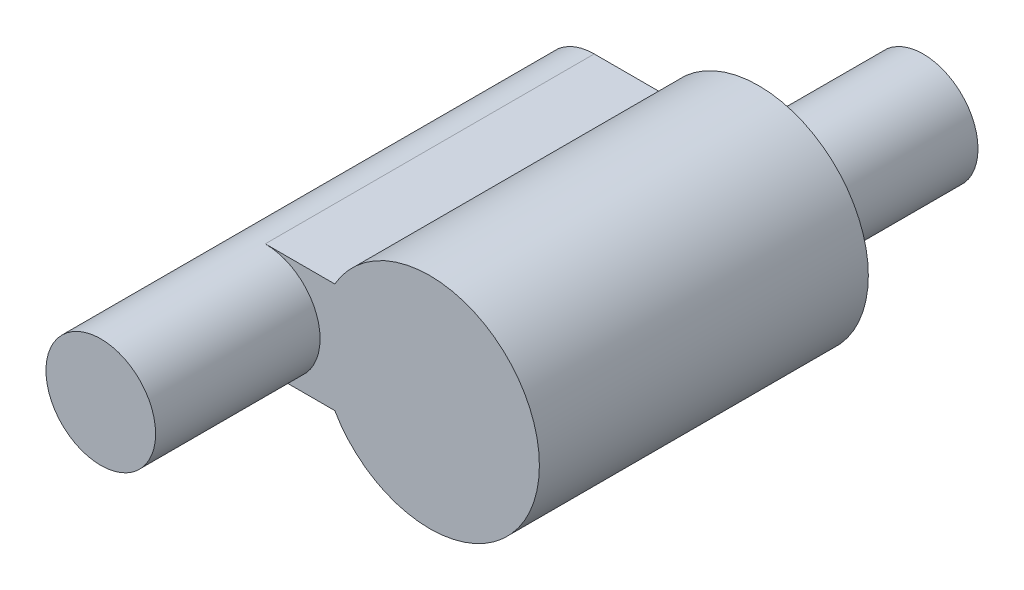
ISO-10303-21;
HEADER;
FILE_DESCRIPTION(('STEP AP214'),'2;1');
FILE_NAME('part.step','',(''),(''),'','','');
FILE_SCHEMA(('AUTOMOTIVE_DESIGN { 1 0 10303 214 1 1 1 1 }'));
ENDSEC;
DATA;
#1=APPLICATION_CONTEXT('core data for automotive mechanical design processes');
#2=APPLICATION_PROTOCOL_DEFINITION('international standard','automotive_design',2000,#1);
#3=PRODUCT_CONTEXT('',#1,'mechanical');
#4=PRODUCT('Part','Part','',(#3));
#5=PRODUCT_RELATED_PRODUCT_CATEGORY('part','',(#4));
#6=PRODUCT_DEFINITION_FORMATION('','',#4);
#7=PRODUCT_DEFINITION_CONTEXT('part definition',#1,'design');
#8=PRODUCT_DEFINITION('design','',#6,#7);
#9=PRODUCT_DEFINITION_SHAPE('','',#8);
#10=(LENGTH_UNIT() NAMED_UNIT(*) SI_UNIT(.MILLI.,.METRE.));
#11=(NAMED_UNIT(*) PLANE_ANGLE_UNIT() SI_UNIT($,.RADIAN.));
#12=(NAMED_UNIT(*) SI_UNIT($,.STERADIAN.) SOLID_ANGLE_UNIT());
#13=UNCERTAINTY_MEASURE_WITH_UNIT(LENGTH_MEASURE(1.E-05),#10,'distance_accuracy_value','');
#14=(GEOMETRIC_REPRESENTATION_CONTEXT(3) GLOBAL_UNCERTAINTY_ASSIGNED_CONTEXT((#13)) GLOBAL_UNIT_ASSIGNED_CONTEXT((#10,
#11,#12)) REPRESENTATION_CONTEXT('',''));
#15=CARTESIAN_POINT('',(0.,0.,0.));
#16=DIRECTION('',(0.,0.,1.));
#17=DIRECTION('',(1.,0.,0.));
#18=AXIS2_PLACEMENT_3D('',#15,#16,#17);
#19=CARTESIAN_POINT('',(0.,8.03163105674594,6.));
#20=DIRECTION('',(0.,1.,0.));
#21=DIRECTION('',(-1.,0.,0.));
#22=AXIS2_PLACEMENT_3D('',#19,#20,#21);
#23=PLANE('',#22);
#24=DIRECTION('',(1.,0.,0.));
#25=VECTOR('',#24,1.);
#26=CARTESIAN_POINT('',(0.,8.03163105674594,0.));
#27=LINE('',#26,#25);
#28=CARTESIAN_POINT('',(-7.06800080293315,8.03163105674595,0.));
#29=VERTEX_POINT('',#28);
#30=CARTESIAN_POINT('',(-5.80005161050203,8.03163105674595,0.));
#31=VERTEX_POINT('',#30);
#32=EDGE_CURVE('E113',#29,#31,#27,.T.);
#33=ORIENTED_EDGE('',*,*,#32,.F.);
#34=DIRECTION('',(0.,0.,-1.));
#35=VECTOR('',#34,1.);
#36=CARTESIAN_POINT('',(-7.06800080293315,8.03163105674595,6.));
#37=LINE('',#36,#35);
#38=CARTESIAN_POINT('',(-7.06800080293315,8.03163105674595,6.));
#39=VERTEX_POINT('',#38);
#40=EDGE_CURVE('E95',#39,#29,#37,.T.);
#41=ORIENTED_EDGE('',*,*,#40,.F.);
#42=DIRECTION('',(1.,0.,0.));
#43=VECTOR('',#42,1.);
#44=CARTESIAN_POINT('',(0.,8.03163105674594,6.));
#45=LINE('',#44,#43);
#46=CARTESIAN_POINT('',(-5.80005161050203,8.03163105674595,6.));
#47=VERTEX_POINT('',#46);
#48=EDGE_CURVE('E106',#39,#47,#45,.T.);
#49=ORIENTED_EDGE('',*,*,#48,.T.);
#50=DIRECTION('',(0.,0.,-1.));
#51=VECTOR('',#50,1.);
#52=CARTESIAN_POINT('',(-5.80005161050203,8.03163105674595,6.));
#53=LINE('',#52,#51);
#54=EDGE_CURVE('E114',#47,#31,#53,.T.);
#55=ORIENTED_EDGE('',*,*,#54,.T.);
#56=EDGE_LOOP('',(#33,#41,#49,#55));
#57=FACE_BOUND('',#56,.T.);
#58=ADVANCED_FACE('F61',(#57),#23,.T.);
#59=CARTESIAN_POINT('',(0.,0.,0.));
#60=DIRECTION('',(0.,0.,1.));
#61=DIRECTION('',(1.,0.,0.));
#62=AXIS2_PLACEMENT_3D('',#59,#60,#61);
#63=PLANE('',#62);
#64=CARTESIAN_POINT('',(-4.06800080293315,7.03163105674595,0.));
#65=DIRECTION('',(0.,0.,1.));
#66=DIRECTION('',(1.,0.,0.));
#67=AXIS2_PLACEMENT_3D('',#64,#65,#66);
#68=CIRCLE('',#67,1.);
#69=CARTESIAN_POINT('',(-3.06800080293315,7.03163105674595,0.));
#70=VERTEX_POINT('',#69);
#71=EDGE_CURVE('E12',#70,#70,#68,.F.);
#72=ORIENTED_EDGE('',*,*,#71,.F.);
#73=EDGE_LOOP('',(#72));
#74=FACE_BOUND('',#73,.T.);
#75=DIRECTION('',(1.,0.,0.));
#76=VECTOR('',#75,1.);
#77=CARTESIAN_POINT('',(0.,6.03163105674596,0.));
#78=LINE('',#77,#76);
#79=CARTESIAN_POINT('',(-7.06800080293315,6.03163105674595,0.));
#80=VERTEX_POINT('',#79);
#81=CARTESIAN_POINT('',(-5.80005161050203,6.03163105674595,0.));
#82=VERTEX_POINT('',#81);
#83=EDGE_CURVE('E128',#80,#82,#78,.T.);
#84=ORIENTED_EDGE('',*,*,#83,.F.);
#85=CARTESIAN_POINT('',(-7.06800080293315,7.03163105674595,0.));
#86=DIRECTION('',(0.,0.,1.));
#87=DIRECTION('',(1.,0.,0.));
#88=AXIS2_PLACEMENT_3D('',#85,#86,#87);
#89=CIRCLE('',#88,1.);
#90=EDGE_CURVE('E97',#29,#80,#89,.T.);
#91=ORIENTED_EDGE('',*,*,#90,.F.);
#92=ORIENTED_EDGE('',*,*,#32,.T.);
#93=CARTESIAN_POINT('',(-4.06800080293315,7.03163105674595,0.));
#94=DIRECTION('',(0.,0.,1.));
#95=DIRECTION('',(1.,0.,0.));
#96=AXIS2_PLACEMENT_3D('',#93,#94,#95);
#97=CIRCLE('',#96,2.);
#98=EDGE_CURVE('E131',#82,#31,#97,.T.);
#99=ORIENTED_EDGE('',*,*,#98,.F.);
#100=EDGE_LOOP('',(#84,#91,#92,#99));
#101=FACE_BOUND('',#100,.T.);
#102=ADVANCED_FACE('F141',(#74,#101),#63,.F.);
#103=CARTESIAN_POINT('',(-4.06800080293315,7.03163105674595,6.));
#104=DIRECTION('',(0.,0.,-1.));
#105=DIRECTION('',(-1.,0.,0.));
#106=AXIS2_PLACEMENT_3D('',#103,#104,#105);
#107=CYLINDRICAL_SURFACE('',#106,2.);
#108=ORIENTED_EDGE('',*,*,#98,.T.);
#109=ORIENTED_EDGE('',*,*,#54,.F.);
#110=CARTESIAN_POINT('',(-4.06800080293315,7.03163105674595,6.));
#111=DIRECTION('',(0.,0.,1.));
#112=DIRECTION('',(1.,0.,0.));
#113=AXIS2_PLACEMENT_3D('',#110,#111,#112);
#114=CIRCLE('',#113,2.);
#115=CARTESIAN_POINT('',(-5.80005161050203,6.03163105674595,6.));
#116=VERTEX_POINT('',#115);
#117=EDGE_CURVE('E103',#116,#47,#114,.T.);
#118=ORIENTED_EDGE('',*,*,#117,.F.);
#119=DIRECTION('',(0.,0.,-1.));
#120=VECTOR('',#119,1.);
#121=CARTESIAN_POINT('',(-5.80005161050203,6.03163105674595,6.));
#122=LINE('',#121,#120);
#123=EDGE_CURVE('E119',#116,#82,#122,.T.);
#124=ORIENTED_EDGE('',*,*,#123,.T.);
#125=EDGE_LOOP('',(#108,#109,#118,#124));
#126=FACE_BOUND('',#125,.T.);
#127=ADVANCED_FACE('F137',(#126),#107,.T.);
#128=CARTESIAN_POINT('',(0.,6.03163105674596,6.));
#129=DIRECTION('',(0.,1.,0.));
#130=DIRECTION('',(-1.,0.,0.));
#131=AXIS2_PLACEMENT_3D('',#128,#129,#130);
#132=PLANE('',#131);
#133=ORIENTED_EDGE('',*,*,#83,.T.);
#134=ORIENTED_EDGE('',*,*,#123,.F.);
#135=DIRECTION('',(1.,0.,0.));
#136=VECTOR('',#135,1.);
#137=CARTESIAN_POINT('',(0.,6.03163105674596,6.));
#138=LINE('',#137,#136);
#139=CARTESIAN_POINT('',(-7.06800080293315,6.03163105674595,6.));
#140=VERTEX_POINT('',#139);
#141=EDGE_CURVE('E125',#140,#116,#138,.T.);
#142=ORIENTED_EDGE('',*,*,#141,.F.);
#143=DIRECTION('',(0.,0.,-1.));
#144=VECTOR('',#143,1.);
#145=CARTESIAN_POINT('',(-7.06800080293315,6.03163105674595,6.));
#146=LINE('',#145,#144);
#147=EDGE_CURVE('E109',#140,#80,#146,.T.);
#148=ORIENTED_EDGE('',*,*,#147,.T.);
#149=EDGE_LOOP('',(#133,#134,#142,#148));
#150=FACE_BOUND('',#149,.T.);
#151=ADVANCED_FACE('F63',(#150),#132,.F.);
#152=CARTESIAN_POINT('',(-7.06800080293315,7.03163105674595,6.));
#153=DIRECTION('',(0.,0.,-1.));
#154=DIRECTION('',(-1.,0.,0.));
#155=AXIS2_PLACEMENT_3D('',#152,#153,#154);
#156=CYLINDRICAL_SURFACE('',#155,1.);
#157=ORIENTED_EDGE('',*,*,#90,.T.);
#158=ORIENTED_EDGE('',*,*,#147,.F.);
#159=CARTESIAN_POINT('',(-7.06800080293315,7.03163105674595,6.));
#160=DIRECTION('',(0.,0.,1.));
#161=DIRECTION('',(1.,0.,0.));
#162=AXIS2_PLACEMENT_3D('',#159,#160,#161);
#163=CIRCLE('',#162,1.);
#164=EDGE_CURVE('E70',#140,#39,#163,.T.);
#165=ORIENTED_EDGE('',*,*,#164,.T.);
#166=ORIENTED_EDGE('',*,*,#40,.T.);
#167=EDGE_LOOP('',(#157,#158,#165,#166));
#168=FACE_BOUND('',#167,.T.);
#169=CARTESIAN_POINT('',(-7.06800080293315,7.03163105674595,9.));
#170=DIRECTION('',(0.,0.,1.));
#171=DIRECTION('',(1.,0.,0.));
#172=AXIS2_PLACEMENT_3D('',#169,#170,#171);
#173=CIRCLE('',#172,1.);
#174=CARTESIAN_POINT('',(-6.06800080293315,7.03163105674595,9.));
#175=VERTEX_POINT('',#174);
#176=EDGE_CURVE('E123',#175,#175,#173,.T.);
#177=ORIENTED_EDGE('',*,*,#176,.F.);
#178=EDGE_LOOP('',(#177));
#179=FACE_BOUND('',#178,.T.);
#180=ADVANCED_FACE('F116',(#168,#179),#156,.T.);
#181=CARTESIAN_POINT('',(0.,0.,6.));
#182=DIRECTION('',(0.,0.,1.));
#183=DIRECTION('',(1.,0.,0.));
#184=AXIS2_PLACEMENT_3D('',#181,#182,#183);
#185=PLANE('',#184);
#186=ORIENTED_EDGE('',*,*,#164,.F.);
#187=ORIENTED_EDGE('',*,*,#141,.T.);
#188=ORIENTED_EDGE('',*,*,#117,.T.);
#189=ORIENTED_EDGE('',*,*,#48,.F.);
#190=EDGE_LOOP('',(#186,#187,#188,#189));
#191=FACE_BOUND('',#190,.T.);
#192=ADVANCED_FACE('F107',(#191),#185,.T.);
#193=CARTESIAN_POINT('',(-7.06800080293315,7.03163105674595,9.));
#194=DIRECTION('',(0.,0.,1.));
#195=DIRECTION('',(1.,0.,0.));
#196=AXIS2_PLACEMENT_3D('',#193,#194,#195);
#197=PLANE('',#196);
#198=ORIENTED_EDGE('',*,*,#176,.T.);
#199=EDGE_LOOP('',(#198));
#200=FACE_BOUND('',#199,.T.);
#201=ADVANCED_FACE('F160',(#200),#197,.T.);
#202=CARTESIAN_POINT('',(-4.06800080293315,7.03163105674595,-3.));
#203=DIRECTION('',(0.,0.,1.));
#204=DIRECTION('',(1.,0.,0.));
#205=AXIS2_PLACEMENT_3D('',#202,#203,#204);
#206=CYLINDRICAL_SURFACE('',#205,1.);
#207=CARTESIAN_POINT('',(-4.06800080293315,7.03163105674595,-3.));
#208=DIRECTION('',(0.,0.,-1.));
#209=DIRECTION('',(-1.,0.,0.));
#210=AXIS2_PLACEMENT_3D('',#207,#208,#209);
#211=CIRCLE('',#210,1.);
#212=CARTESIAN_POINT('',(-5.06800080293315,7.03163105674595,-3.));
#213=VERTEX_POINT('',#212);
#214=EDGE_CURVE('E175',#213,#213,#211,.T.);
#215=ORIENTED_EDGE('',*,*,#214,.F.);
#216=EDGE_LOOP('',(#215));
#217=FACE_BOUND('',#216,.T.);
#218=ORIENTED_EDGE('',*,*,#71,.T.);
#219=EDGE_LOOP('',(#218));
#220=FACE_BOUND('',#219,.T.);
#221=ADVANCED_FACE('F163',(#217,#220),#206,.T.);
#222=CARTESIAN_POINT('',(-4.06800080293315,7.03163105674595,-3.));
#223=DIRECTION('',(0.,0.,-1.));
#224=DIRECTION('',(-1.,0.,0.));
#225=AXIS2_PLACEMENT_3D('',#222,#223,#224);
#226=PLANE('',#225);
#227=ORIENTED_EDGE('',*,*,#214,.T.);
#228=EDGE_LOOP('',(#227));
#229=FACE_BOUND('',#228,.T.);
#230=ADVANCED_FACE('F167',(#229),#226,.T.);
#231=CLOSED_SHELL('',(#58,#102,#127,#151,#180,#192,#201,#221,#230));
#232=MANIFOLD_SOLID_BREP('B2',#231);
#233=ADVANCED_BREP_SHAPE_REPRESENTATION('',(#18,#232),#14);
#234=SHAPE_DEFINITION_REPRESENTATION(#9,#233);
ENDSEC;
END-ISO-10303-21;
